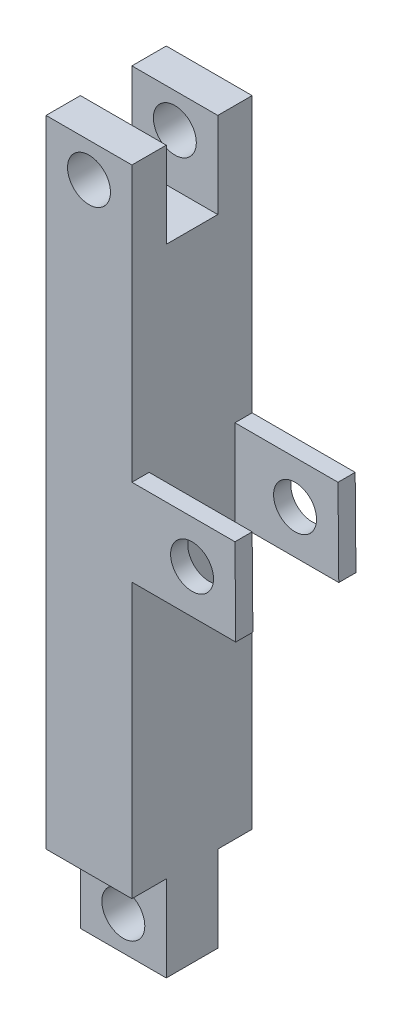
ISO-10303-21;
HEADER;
FILE_DESCRIPTION(('STEP AP214'),'2;1');
FILE_NAME('part.step','',(''),(''),'','','');
FILE_SCHEMA(('AUTOMOTIVE_DESIGN { 1 0 10303 214 1 1 1 1 }'));
ENDSEC;
DATA;
#1=APPLICATION_CONTEXT('core data for automotive mechanical design processes');
#2=APPLICATION_PROTOCOL_DEFINITION('international standard','automotive_design',2000,#1);
#3=PRODUCT_CONTEXT('',#1,'mechanical');
#4=PRODUCT('Part','Part','',(#3));
#5=PRODUCT_RELATED_PRODUCT_CATEGORY('part','',(#4));
#6=PRODUCT_DEFINITION_FORMATION('','',#4);
#7=PRODUCT_DEFINITION_CONTEXT('part definition',#1,'design');
#8=PRODUCT_DEFINITION('design','',#6,#7);
#9=PRODUCT_DEFINITION_SHAPE('','',#8);
#10=(LENGTH_UNIT() NAMED_UNIT(*) SI_UNIT(.MILLI.,.METRE.));
#11=(NAMED_UNIT(*) PLANE_ANGLE_UNIT() SI_UNIT($,.RADIAN.));
#12=(NAMED_UNIT(*) SI_UNIT($,.STERADIAN.) SOLID_ANGLE_UNIT());
#13=UNCERTAINTY_MEASURE_WITH_UNIT(LENGTH_MEASURE(1.E-05),#10,'distance_accuracy_value','');
#14=(GEOMETRIC_REPRESENTATION_CONTEXT(3) GLOBAL_UNCERTAINTY_ASSIGNED_CONTEXT((#13)) GLOBAL_UNIT_ASSIGNED_CONTEXT((#10,
#11,#12)) REPRESENTATION_CONTEXT('',''));
#15=CARTESIAN_POINT('',(0.,0.,0.));
#16=DIRECTION('',(0.,0.,1.));
#17=DIRECTION('',(1.,0.,0.));
#18=AXIS2_PLACEMENT_3D('',#15,#16,#17);
#19=CARTESIAN_POINT('',(0.,-37.,0.));
#20=DIRECTION('',(0.,-1.,0.));
#21=DIRECTION('',(0.,0.,-1.));
#22=AXIS2_PLACEMENT_3D('',#19,#20,#21);
#23=PLANE('',#22);
#24=DIRECTION('',(0.,0.,-1.));
#25=VECTOR('',#24,1.);
#26=CARTESIAN_POINT('',(5.,-37.,-7.));
#27=LINE('',#26,#25);
#28=CARTESIAN_POINT('',(5.,-37.,-3.));
#29=VERTEX_POINT('',#28);
#30=CARTESIAN_POINT('',(5.,-37.,-7.));
#31=VERTEX_POINT('',#30);
#32=EDGE_CURVE('E58',#29,#31,#27,.T.);
#33=ORIENTED_EDGE('',*,*,#32,.F.);
#34=DIRECTION('',(-1.,0.,0.));
#35=VECTOR('',#34,1.);
#36=CARTESIAN_POINT('',(-5.,-37.,-3.));
#37=LINE('',#36,#35);
#38=CARTESIAN_POINT('',(-5.,-37.,-3.));
#39=VERTEX_POINT('',#38);
#40=EDGE_CURVE('E53',#29,#39,#37,.T.);
#41=ORIENTED_EDGE('',*,*,#40,.T.);
#42=DIRECTION('',(0.,0.,1.));
#43=VECTOR('',#42,1.);
#44=CARTESIAN_POINT('',(-5.,-37.,-7.));
#45=LINE('',#44,#43);
#46=CARTESIAN_POINT('',(-5.,-37.,-7.));
#47=VERTEX_POINT('',#46);
#48=EDGE_CURVE('E311',#47,#39,#45,.T.);
#49=ORIENTED_EDGE('',*,*,#48,.F.);
#50=DIRECTION('',(-1.,0.,0.));
#51=VECTOR('',#50,1.);
#52=CARTESIAN_POINT('',(5.,-37.,-7.));
#53=LINE('',#52,#51);
#54=EDGE_CURVE('E308',#31,#47,#53,.T.);
#55=ORIENTED_EDGE('',*,*,#54,.F.);
#56=EDGE_LOOP('',(#33,#41,#49,#55));
#57=FACE_BOUND('',#56,.T.);
#58=ADVANCED_FACE('F36',(#57),#23,.T.);
#59=CARTESIAN_POINT('',(5.,37.,-7.));
#60=DIRECTION('',(-1.,0.,0.));
#61=DIRECTION('',(0.,0.,1.));
#62=AXIS2_PLACEMENT_3D('',#59,#60,#61);
#63=PLANE('',#62);
#64=DIRECTION('',(0.,1.,0.));
#65=VECTOR('',#64,1.);
#66=CARTESIAN_POINT('',(5.,37.,-3.));
#67=LINE('',#66,#65);
#68=CARTESIAN_POINT('',(5.,27.,-3.));
#69=VERTEX_POINT('',#68);
#70=CARTESIAN_POINT('',(5.,37.,-3.));
#71=VERTEX_POINT('',#70);
#72=EDGE_CURVE('E214',#69,#71,#67,.T.);
#73=ORIENTED_EDGE('',*,*,#72,.F.);
#74=DIRECTION('',(0.,0.,1.));
#75=VECTOR('',#74,1.);
#76=CARTESIAN_POINT('',(5.,27.,-3.));
#77=LINE('',#76,#75);
#78=CARTESIAN_POINT('',(5.,27.,3.));
#79=VERTEX_POINT('',#78);
#80=EDGE_CURVE('E226',#69,#79,#77,.T.);
#81=ORIENTED_EDGE('',*,*,#80,.T.);
#82=DIRECTION('',(0.,1.,0.));
#83=VECTOR('',#82,1.);
#84=CARTESIAN_POINT('',(5.,37.,3.));
#85=LINE('',#84,#83);
#86=CARTESIAN_POINT('',(5.,37.,3.));
#87=VERTEX_POINT('',#86);
#88=EDGE_CURVE('E221',#79,#87,#85,.T.);
#89=ORIENTED_EDGE('',*,*,#88,.T.);
#90=DIRECTION('',(0.,0.,-1.));
#91=VECTOR('',#90,1.);
#92=CARTESIAN_POINT('',(5.,37.,-7.));
#93=LINE('',#92,#91);
#94=CARTESIAN_POINT('',(5.,37.,7.));
#95=VERTEX_POINT('',#94);
#96=EDGE_CURVE('E292',#95,#87,#93,.T.);
#97=ORIENTED_EDGE('',*,*,#96,.F.);
#98=DIRECTION('',(0.,-1.,0.));
#99=VECTOR('',#98,1.);
#100=CARTESIAN_POINT('',(5.,37.,7.));
#101=LINE('',#100,#99);
#102=CARTESIAN_POINT('',(5.,5.,7.));
#103=VERTEX_POINT('',#102);
#104=EDGE_CURVE('E316',#95,#103,#101,.T.);
#105=ORIENTED_EDGE('',*,*,#104,.T.);
#106=DIRECTION('',(0.,0.,-1.));
#107=VECTOR('',#106,1.);
#108=CARTESIAN_POINT('',(5.,5.,7.));
#109=LINE('',#108,#107);
#110=CARTESIAN_POINT('',(5.,5.,5.));
#111=VERTEX_POINT('',#110);
#112=EDGE_CURVE('E285',#103,#111,#109,.T.);
#113=ORIENTED_EDGE('',*,*,#112,.T.);
#114=DIRECTION('',(0.,-1.,0.));
#115=VECTOR('',#114,1.);
#116=CARTESIAN_POINT('',(5.,5.,5.));
#117=LINE('',#116,#115);
#118=CARTESIAN_POINT('',(5.,-5.07196207042677,5.));
#119=VERTEX_POINT('',#118);
#120=EDGE_CURVE('E240',#111,#119,#117,.T.);
#121=ORIENTED_EDGE('',*,*,#120,.T.);
#122=DIRECTION('',(0.,0.,-1.));
#123=VECTOR('',#122,1.);
#124=CARTESIAN_POINT('',(5.,-5.07196207042677,7.));
#125=LINE('',#124,#123);
#126=CARTESIAN_POINT('',(5.,-5.07196207042677,7.));
#127=VERTEX_POINT('',#126);
#128=EDGE_CURVE('E281',#127,#119,#125,.T.);
#129=ORIENTED_EDGE('',*,*,#128,.F.);
#130=CARTESIAN_POINT('',(5.,-37.,7.));
#131=VERTEX_POINT('',#130);
#132=EDGE_CURVE('E304',#127,#131,#101,.T.);
#133=ORIENTED_EDGE('',*,*,#132,.T.);
#134=CARTESIAN_POINT('',(5.,-37.,3.));
#135=VERTEX_POINT('',#134);
#136=EDGE_CURVE('E305',#131,#135,#27,.T.);
#137=ORIENTED_EDGE('',*,*,#136,.T.);
#138=DIRECTION('',(0.,1.,0.));
#139=VECTOR('',#138,1.);
#140=CARTESIAN_POINT('',(5.,-37.,3.));
#141=LINE('',#140,#139);
#142=CARTESIAN_POINT('',(5.,-47.,3.));
#143=VERTEX_POINT('',#142);
#144=EDGE_CURVE('E186',#143,#135,#141,.T.);
#145=ORIENTED_EDGE('',*,*,#144,.F.);
#146=DIRECTION('',(0.,0.,-1.));
#147=VECTOR('',#146,1.);
#148=CARTESIAN_POINT('',(5.,-47.,3.));
#149=LINE('',#148,#147);
#150=CARTESIAN_POINT('',(5.,-47.,-3.));
#151=VERTEX_POINT('',#150);
#152=EDGE_CURVE('E182',#143,#151,#149,.T.);
#153=ORIENTED_EDGE('',*,*,#152,.T.);
#154=DIRECTION('',(0.,1.,0.));
#155=VECTOR('',#154,1.);
#156=CARTESIAN_POINT('',(5.,-37.,-3.));
#157=LINE('',#156,#155);
#158=EDGE_CURVE('E349',#151,#29,#157,.T.);
#159=ORIENTED_EDGE('',*,*,#158,.T.);
#160=ORIENTED_EDGE('',*,*,#32,.T.);
#161=DIRECTION('',(0.,-1.,0.));
#162=VECTOR('',#161,1.);
#163=CARTESIAN_POINT('',(5.,37.,-7.));
#164=LINE('',#163,#162);
#165=CARTESIAN_POINT('',(5.,-5.07196207042677,-7.));
#166=VERTEX_POINT('',#165);
#167=EDGE_CURVE('E45',#166,#31,#164,.T.);
#168=ORIENTED_EDGE('',*,*,#167,.F.);
#169=CARTESIAN_POINT('',(5.,-5.07196207042677,-5.));
#170=VERTEX_POINT('',#169);
#171=EDGE_CURVE('E280',#170,#166,#125,.T.);
#172=ORIENTED_EDGE('',*,*,#171,.F.);
#173=DIRECTION('',(0.,-1.,0.));
#174=VECTOR('',#173,1.);
#175=CARTESIAN_POINT('',(5.,5.,-5.));
#176=LINE('',#175,#174);
#177=CARTESIAN_POINT('',(5.,5.,-5.));
#178=VERTEX_POINT('',#177);
#179=EDGE_CURVE('E241',#178,#170,#176,.T.);
#180=ORIENTED_EDGE('',*,*,#179,.F.);
#181=CARTESIAN_POINT('',(5.,5.,-7.));
#182=VERTEX_POINT('',#181);
#183=EDGE_CURVE('E284',#178,#182,#109,.T.);
#184=ORIENTED_EDGE('',*,*,#183,.T.);
#185=CARTESIAN_POINT('',(5.,37.,-7.));
#186=VERTEX_POINT('',#185);
#187=EDGE_CURVE('E11',#186,#182,#164,.T.);
#188=ORIENTED_EDGE('',*,*,#187,.F.);
#189=EDGE_CURVE('E296',#71,#186,#93,.T.);
#190=ORIENTED_EDGE('',*,*,#189,.F.);
#191=EDGE_LOOP('',(#73,#81,#89,#97,#105,#113,#121,#129,#133,#137,#145,#153,#159,#160,#168,#172,
#180,#184,#188,#190));
#192=FACE_BOUND('',#191,.T.);
#193=ADVANCED_FACE('F38',(#192),#63,.F.);
#194=CARTESIAN_POINT('',(-5.,37.,-7.));
#195=DIRECTION('',(1.,0.,0.));
#196=DIRECTION('',(0.,0.,-1.));
#197=AXIS2_PLACEMENT_3D('',#194,#195,#196);
#198=PLANE('',#197);
#199=DIRECTION('',(0.,-1.,0.));
#200=VECTOR('',#199,1.);
#201=CARTESIAN_POINT('',(-5.,37.,-3.));
#202=LINE('',#201,#200);
#203=CARTESIAN_POINT('',(-5.,37.,-3.));
#204=VERTEX_POINT('',#203);
#205=CARTESIAN_POINT('',(-5.,27.,-3.));
#206=VERTEX_POINT('',#205);
#207=EDGE_CURVE('E207',#204,#206,#202,.T.);
#208=ORIENTED_EDGE('',*,*,#207,.F.);
#209=DIRECTION('',(0.,0.,1.));
#210=VECTOR('',#209,1.);
#211=CARTESIAN_POINT('',(-5.,37.,-7.));
#212=LINE('',#211,#210);
#213=CARTESIAN_POINT('',(-5.,37.,-7.));
#214=VERTEX_POINT('',#213);
#215=EDGE_CURVE('E299',#214,#204,#212,.T.);
#216=ORIENTED_EDGE('',*,*,#215,.F.);
#217=DIRECTION('',(0.,-1.,0.));
#218=VECTOR('',#217,1.);
#219=CARTESIAN_POINT('',(-5.,37.,-7.));
#220=LINE('',#219,#218);
#221=EDGE_CURVE('E322',#214,#47,#220,.T.);
#222=ORIENTED_EDGE('',*,*,#221,.T.);
#223=ORIENTED_EDGE('',*,*,#48,.T.);
#224=DIRECTION('',(0.,-1.,0.));
#225=VECTOR('',#224,1.);
#226=CARTESIAN_POINT('',(-5.,-37.,-3.));
#227=LINE('',#226,#225);
#228=CARTESIAN_POINT('',(-5.,-47.,-3.));
#229=VERTEX_POINT('',#228);
#230=EDGE_CURVE('E198',#39,#229,#227,.T.);
#231=ORIENTED_EDGE('',*,*,#230,.T.);
#232=DIRECTION('',(0.,0.,-1.));
#233=VECTOR('',#232,1.);
#234=CARTESIAN_POINT('',(-5.,-47.,3.));
#235=LINE('',#234,#233);
#236=CARTESIAN_POINT('',(-5.,-47.,3.));
#237=VERTEX_POINT('',#236);
#238=EDGE_CURVE('E179',#237,#229,#235,.T.);
#239=ORIENTED_EDGE('',*,*,#238,.F.);
#240=DIRECTION('',(0.,-1.,0.));
#241=VECTOR('',#240,1.);
#242=CARTESIAN_POINT('',(-5.,-37.,3.));
#243=LINE('',#242,#241);
#244=CARTESIAN_POINT('',(-5.,-37.,3.));
#245=VERTEX_POINT('',#244);
#246=EDGE_CURVE('E187',#245,#237,#243,.T.);
#247=ORIENTED_EDGE('',*,*,#246,.F.);
#248=CARTESIAN_POINT('',(-5.,-37.,7.));
#249=VERTEX_POINT('',#248);
#250=EDGE_CURVE('E310',#245,#249,#45,.T.);
#251=ORIENTED_EDGE('',*,*,#250,.T.);
#252=DIRECTION('',(0.,-1.,0.));
#253=VECTOR('',#252,1.);
#254=CARTESIAN_POINT('',(-5.,37.,7.));
#255=LINE('',#254,#253);
#256=CARTESIAN_POINT('',(-5.,37.,7.));
#257=VERTEX_POINT('',#256);
#258=EDGE_CURVE('E319',#257,#249,#255,.T.);
#259=ORIENTED_EDGE('',*,*,#258,.F.);
#260=CARTESIAN_POINT('',(-5.,37.,3.));
#261=VERTEX_POINT('',#260);
#262=EDGE_CURVE('E298',#261,#257,#212,.T.);
#263=ORIENTED_EDGE('',*,*,#262,.F.);
#264=DIRECTION('',(0.,-1.,0.));
#265=VECTOR('',#264,1.);
#266=CARTESIAN_POINT('',(-5.,37.,3.));
#267=LINE('',#266,#265);
#268=CARTESIAN_POINT('',(-5.,27.,3.));
#269=VERTEX_POINT('',#268);
#270=EDGE_CURVE('E199',#261,#269,#267,.T.);
#271=ORIENTED_EDGE('',*,*,#270,.T.);
#272=DIRECTION('',(0.,0.,1.));
#273=VECTOR('',#272,1.);
#274=CARTESIAN_POINT('',(-5.,27.,-3.));
#275=LINE('',#274,#273);
#276=EDGE_CURVE('E217',#206,#269,#275,.T.);
#277=ORIENTED_EDGE('',*,*,#276,.F.);
#278=EDGE_LOOP('',(#208,#216,#222,#223,#231,#239,#247,#251,#259,#263,#271,#277));
#279=FACE_BOUND('',#278,.T.);
#280=ADVANCED_FACE('F196',(#279),#198,.F.);
#281=CARTESIAN_POINT('',(0.,37.,0.));
#282=DIRECTION('',(0.,-1.,0.));
#283=DIRECTION('',(0.,0.,-1.));
#284=AXIS2_PLACEMENT_3D('',#281,#282,#283);
#285=PLANE('',#284);
#286=DIRECTION('',(-1.,0.,0.));
#287=VECTOR('',#286,1.);
#288=CARTESIAN_POINT('',(-5.,37.,-3.));
#289=LINE('',#288,#287);
#290=EDGE_CURVE('E216',#71,#204,#289,.T.);
#291=ORIENTED_EDGE('',*,*,#290,.F.);
#292=ORIENTED_EDGE('',*,*,#189,.T.);
#293=DIRECTION('',(-1.,0.,0.));
#294=VECTOR('',#293,1.);
#295=CARTESIAN_POINT('',(5.,37.,-7.));
#296=LINE('',#295,#294);
#297=EDGE_CURVE('E295',#186,#214,#296,.T.);
#298=ORIENTED_EDGE('',*,*,#297,.T.);
#299=ORIENTED_EDGE('',*,*,#215,.T.);
#300=EDGE_LOOP('',(#291,#292,#298,#299));
#301=FACE_BOUND('',#300,.T.);
#302=ADVANCED_FACE('F394',(#301),#285,.F.);
#303=CARTESIAN_POINT('',(17.,5.,7.));
#304=DIRECTION('',(-0.999959845190565,-0.00896147345366372,0.));
#305=DIRECTION('',(0.00896147345366372,-0.999959845190565,0.));
#306=AXIS2_PLACEMENT_3D('',#303,#304,#305);
#307=PLANE('',#306);
#308=DIRECTION('',(-0.00896147345366372,0.999959845190565,0.));
#309=VECTOR('',#308,1.);
#310=CARTESIAN_POINT('',(17.,5.,-5.));
#311=LINE('',#310,#309);
#312=CARTESIAN_POINT('',(17.0902632452238,-5.07196207042677,-5.));
#313=VERTEX_POINT('',#312);
#314=CARTESIAN_POINT('',(17.,5.,-5.));
#315=VERTEX_POINT('',#314);
#316=EDGE_CURVE('E258',#313,#315,#311,.T.);
#317=ORIENTED_EDGE('',*,*,#316,.F.);
#318=DIRECTION('',(0.,0.,-1.));
#319=VECTOR('',#318,1.);
#320=CARTESIAN_POINT('',(17.0902632452238,-5.07196207042677,7.));
#321=LINE('',#320,#319);
#322=CARTESIAN_POINT('',(17.0902632452238,-5.07196207042677,-7.));
#323=VERTEX_POINT('',#322);
#324=EDGE_CURVE('E269',#313,#323,#321,.T.);
#325=ORIENTED_EDGE('',*,*,#324,.T.);
#326=DIRECTION('',(-0.00896147345366372,0.999959845190565,0.));
#327=VECTOR('',#326,1.);
#328=CARTESIAN_POINT('',(17.,5.,-7.));
#329=LINE('',#328,#327);
#330=CARTESIAN_POINT('',(17.,5.,-7.));
#331=VERTEX_POINT('',#330);
#332=EDGE_CURVE('E260',#323,#331,#329,.T.);
#333=ORIENTED_EDGE('',*,*,#332,.T.);
#334=DIRECTION('',(0.,0.,-1.));
#335=VECTOR('',#334,1.);
#336=CARTESIAN_POINT('',(17.,5.,7.));
#337=LINE('',#336,#335);
#338=EDGE_CURVE('E288',#315,#331,#337,.T.);
#339=ORIENTED_EDGE('',*,*,#338,.F.);
#340=EDGE_LOOP('',(#317,#325,#333,#339));
#341=FACE_BOUND('',#340,.T.);
#342=ADVANCED_FACE('F391',(#341),#307,.F.);
#343=CARTESIAN_POINT('',(5.,5.,7.));
#344=DIRECTION('',(0.,-1.,0.));
#345=DIRECTION('',(0.,0.,-1.));
#346=AXIS2_PLACEMENT_3D('',#343,#344,#345);
#347=PLANE('',#346);
#348=DIRECTION('',(-1.,0.,0.));
#349=VECTOR('',#348,1.);
#350=CARTESIAN_POINT('',(5.,5.,-5.));
#351=LINE('',#350,#349);
#352=EDGE_CURVE('E246',#315,#178,#351,.T.);
#353=ORIENTED_EDGE('',*,*,#352,.F.);
#354=ORIENTED_EDGE('',*,*,#338,.T.);
#355=DIRECTION('',(-1.,0.,0.));
#356=VECTOR('',#355,1.);
#357=CARTESIAN_POINT('',(5.,5.,-7.));
#358=LINE('',#357,#356);
#359=EDGE_CURVE('E272',#331,#182,#358,.T.);
#360=ORIENTED_EDGE('',*,*,#359,.T.);
#361=ORIENTED_EDGE('',*,*,#183,.F.);
#362=EDGE_LOOP('',(#353,#354,#360,#361));
#363=FACE_BOUND('',#362,.T.);
#364=ADVANCED_FACE('F439',(#363),#347,.F.);
#365=CARTESIAN_POINT('',(17.0902632452238,-5.07196207042677,7.));
#366=DIRECTION('',(0.,1.,0.));
#367=DIRECTION('',(-1.,0.,0.));
#368=AXIS2_PLACEMENT_3D('',#365,#366,#367);
#369=PLANE('',#368);
#370=DIRECTION('',(1.,0.,0.));
#371=VECTOR('',#370,1.);
#372=CARTESIAN_POINT('',(5.,-5.07196207042677,-5.));
#373=LINE('',#372,#371);
#374=EDGE_CURVE('E243',#170,#313,#373,.T.);
#375=ORIENTED_EDGE('',*,*,#374,.F.);
#376=ORIENTED_EDGE('',*,*,#171,.T.);
#377=DIRECTION('',(1.,0.,0.));
#378=VECTOR('',#377,1.);
#379=CARTESIAN_POINT('',(17.0902632452238,-5.07196207042677,-7.));
#380=LINE('',#379,#378);
#381=EDGE_CURVE('E265',#166,#323,#380,.T.);
#382=ORIENTED_EDGE('',*,*,#381,.T.);
#383=ORIENTED_EDGE('',*,*,#324,.F.);
#384=EDGE_LOOP('',(#375,#376,#382,#383));
#385=FACE_BOUND('',#384,.T.);
#386=ADVANCED_FACE('F429',(#385),#369,.F.);
#387=CARTESIAN_POINT('',(5.,37.,-7.));
#388=DIRECTION('',(0.,0.,1.));
#389=DIRECTION('',(1.,0.,0.));
#390=AXIS2_PLACEMENT_3D('',#387,#388,#389);
#391=PLANE('',#390);
#392=CARTESIAN_POINT('',(0.,33.,-7.));
#393=DIRECTION('',(0.,0.,1.));
#394=DIRECTION('',(1.,0.,0.));
#395=AXIS2_PLACEMENT_3D('',#392,#393,#394);
#396=CIRCLE('',#395,2.5);
#397=CARTESIAN_POINT('',(2.5,33.,-7.));
#398=VERTEX_POINT('',#397);
#399=EDGE_CURVE('E329',#398,#398,#396,.T.);
#400=ORIENTED_EDGE('',*,*,#399,.T.);
#401=EDGE_LOOP('',(#400));
#402=FACE_BOUND('',#401,.T.);
#403=CARTESIAN_POINT('',(12.,0.,-7.));
#404=DIRECTION('',(0.,0.,1.));
#405=DIRECTION('',(1.,0.,0.));
#406=AXIS2_PLACEMENT_3D('',#403,#404,#405);
#407=CIRCLE('',#406,2.5);
#408=CARTESIAN_POINT('',(14.5,0.,-7.));
#409=VERTEX_POINT('',#408);
#410=EDGE_CURVE('E233',#409,#409,#407,.T.);
#411=ORIENTED_EDGE('',*,*,#410,.T.);
#412=EDGE_LOOP('',(#411));
#413=FACE_BOUND('',#412,.T.);
#414=ORIENTED_EDGE('',*,*,#54,.T.);
#415=ORIENTED_EDGE('',*,*,#221,.F.);
#416=ORIENTED_EDGE('',*,*,#297,.F.);
#417=ORIENTED_EDGE('',*,*,#187,.T.);
#418=ORIENTED_EDGE('',*,*,#359,.F.);
#419=ORIENTED_EDGE('',*,*,#332,.F.);
#420=ORIENTED_EDGE('',*,*,#381,.F.);
#421=ORIENTED_EDGE('',*,*,#167,.T.);
#422=EDGE_LOOP('',(#414,#415,#416,#417,#418,#419,#420,#421));
#423=FACE_BOUND('',#422,.T.);
#424=ADVANCED_FACE('F421',(#402,#413,#423),#391,.F.);
#425=CARTESIAN_POINT('',(5.,37.,7.));
#426=DIRECTION('',(0.,0.,-1.));
#427=DIRECTION('',(-1.,0.,0.));
#428=AXIS2_PLACEMENT_3D('',#425,#426,#427);
#429=PLANE('',#428);
#430=CARTESIAN_POINT('',(0.,33.,7.));
#431=DIRECTION('',(0.,0.,1.));
#432=DIRECTION('',(1.,0.,0.));
#433=AXIS2_PLACEMENT_3D('',#430,#431,#432);
#434=CIRCLE('',#433,2.5);
#435=CARTESIAN_POINT('',(2.5,33.,7.));
#436=VERTEX_POINT('',#435);
#437=EDGE_CURVE('E335',#436,#436,#434,.T.);
#438=ORIENTED_EDGE('',*,*,#437,.F.);
#439=EDGE_LOOP('',(#438));
#440=FACE_BOUND('',#439,.T.);
#441=CARTESIAN_POINT('',(12.,0.,7.));
#442=DIRECTION('',(0.,0.,1.));
#443=DIRECTION('',(1.,0.,0.));
#444=AXIS2_PLACEMENT_3D('',#441,#442,#443);
#445=CIRCLE('',#444,2.5);
#446=CARTESIAN_POINT('',(14.5,0.,7.));
#447=VERTEX_POINT('',#446);
#448=EDGE_CURVE('E229',#447,#447,#445,.T.);
#449=ORIENTED_EDGE('',*,*,#448,.F.);
#450=EDGE_LOOP('',(#449));
#451=FACE_BOUND('',#450,.T.);
#452=DIRECTION('',(1.,0.,0.));
#453=VECTOR('',#452,1.);
#454=CARTESIAN_POINT('',(5.,-37.,7.));
#455=LINE('',#454,#453);
#456=EDGE_CURVE('E313',#249,#131,#455,.T.);
#457=ORIENTED_EDGE('',*,*,#456,.T.);
#458=ORIENTED_EDGE('',*,*,#132,.F.);
#459=DIRECTION('',(1.,0.,0.));
#460=VECTOR('',#459,1.);
#461=CARTESIAN_POINT('',(17.0902632452238,-5.07196207042677,7.));
#462=LINE('',#461,#460);
#463=CARTESIAN_POINT('',(17.0902632452238,-5.07196207042677,7.));
#464=VERTEX_POINT('',#463);
#465=EDGE_CURVE('E267',#127,#464,#462,.T.);
#466=ORIENTED_EDGE('',*,*,#465,.T.);
#467=DIRECTION('',(-0.00896147345366372,0.999959845190565,0.));
#468=VECTOR('',#467,1.);
#469=CARTESIAN_POINT('',(17.,5.,7.));
#470=LINE('',#469,#468);
#471=CARTESIAN_POINT('',(17.,5.,7.));
#472=VERTEX_POINT('',#471);
#473=EDGE_CURVE('E261',#464,#472,#470,.T.);
#474=ORIENTED_EDGE('',*,*,#473,.T.);
#475=DIRECTION('',(-1.,0.,0.));
#476=VECTOR('',#475,1.);
#477=CARTESIAN_POINT('',(5.,5.,7.));
#478=LINE('',#477,#476);
#479=EDGE_CURVE('E264',#472,#103,#478,.T.);
#480=ORIENTED_EDGE('',*,*,#479,.T.);
#481=ORIENTED_EDGE('',*,*,#104,.F.);
#482=DIRECTION('',(1.,0.,0.));
#483=VECTOR('',#482,1.);
#484=CARTESIAN_POINT('',(5.,37.,7.));
#485=LINE('',#484,#483);
#486=EDGE_CURVE('E302',#257,#95,#485,.T.);
#487=ORIENTED_EDGE('',*,*,#486,.F.);
#488=ORIENTED_EDGE('',*,*,#258,.T.);
#489=EDGE_LOOP('',(#457,#458,#466,#474,#480,#481,#487,#488));
#490=FACE_BOUND('',#489,.T.);
#491=ADVANCED_FACE('F392',(#440,#451,#490),#429,.F.);
#492=ORIENTED_EDGE('',*,*,#96,.T.);
#493=DIRECTION('',(-1.,0.,0.));
#494=VECTOR('',#493,1.);
#495=CARTESIAN_POINT('',(-5.,37.,3.));
#496=LINE('',#495,#494);
#497=EDGE_CURVE('E211',#87,#261,#496,.T.);
#498=ORIENTED_EDGE('',*,*,#497,.T.);
#499=ORIENTED_EDGE('',*,*,#262,.T.);
#500=ORIENTED_EDGE('',*,*,#486,.T.);
#501=EDGE_LOOP('',(#492,#498,#499,#500));
#502=FACE_BOUND('',#501,.T.);
#503=ADVANCED_FACE('F382',(#502),#285,.F.);
#504=DIRECTION('',(-1.,0.,0.));
#505=VECTOR('',#504,1.);
#506=CARTESIAN_POINT('',(-5.,-37.,3.));
#507=LINE('',#506,#505);
#508=EDGE_CURVE('E192',#135,#245,#507,.T.);
#509=ORIENTED_EDGE('',*,*,#508,.F.);
#510=ORIENTED_EDGE('',*,*,#136,.F.);
#511=ORIENTED_EDGE('',*,*,#456,.F.);
#512=ORIENTED_EDGE('',*,*,#250,.F.);
#513=EDGE_LOOP('',(#509,#510,#511,#512));
#514=FACE_BOUND('',#513,.T.);
#515=ADVANCED_FACE('F374',(#514),#23,.T.);
#516=CARTESIAN_POINT('',(17.0902632452238,-5.07196207042677,5.));
#517=VERTEX_POINT('',#516);
#518=EDGE_CURVE('E277',#464,#517,#321,.T.);
#519=ORIENTED_EDGE('',*,*,#518,.T.);
#520=DIRECTION('',(-0.00896147345366372,0.999959845190565,0.));
#521=VECTOR('',#520,1.);
#522=CARTESIAN_POINT('',(17.,5.,5.));
#523=LINE('',#522,#521);
#524=CARTESIAN_POINT('',(17.,5.,5.));
#525=VERTEX_POINT('',#524);
#526=EDGE_CURVE('E248',#517,#525,#523,.T.);
#527=ORIENTED_EDGE('',*,*,#526,.T.);
#528=EDGE_CURVE('E289',#472,#525,#337,.T.);
#529=ORIENTED_EDGE('',*,*,#528,.F.);
#530=ORIENTED_EDGE('',*,*,#473,.F.);
#531=EDGE_LOOP('',(#519,#527,#529,#530));
#532=FACE_BOUND('',#531,.T.);
#533=ADVANCED_FACE('F381',(#532),#307,.F.);
#534=ORIENTED_EDGE('',*,*,#528,.T.);
#535=DIRECTION('',(-1.,0.,0.));
#536=VECTOR('',#535,1.);
#537=CARTESIAN_POINT('',(5.,5.,5.));
#538=LINE('',#537,#536);
#539=EDGE_CURVE('E244',#525,#111,#538,.T.);
#540=ORIENTED_EDGE('',*,*,#539,.T.);
#541=ORIENTED_EDGE('',*,*,#112,.F.);
#542=ORIENTED_EDGE('',*,*,#479,.F.);
#543=EDGE_LOOP('',(#534,#540,#541,#542));
#544=FACE_BOUND('',#543,.T.);
#545=ADVANCED_FACE('F388',(#544),#347,.F.);
#546=ORIENTED_EDGE('',*,*,#128,.T.);
#547=DIRECTION('',(1.,0.,0.));
#548=VECTOR('',#547,1.);
#549=CARTESIAN_POINT('',(5.,-5.07196207042677,5.));
#550=LINE('',#549,#548);
#551=EDGE_CURVE('E251',#119,#517,#550,.T.);
#552=ORIENTED_EDGE('',*,*,#551,.T.);
#553=ORIENTED_EDGE('',*,*,#518,.F.);
#554=ORIENTED_EDGE('',*,*,#465,.F.);
#555=EDGE_LOOP('',(#546,#552,#553,#554));
#556=FACE_BOUND('',#555,.T.);
#557=ADVANCED_FACE('F447',(#556),#369,.F.);
#558=CARTESIAN_POINT('',(0.,0.,-5.));
#559=DIRECTION('',(0.,0.,1.));
#560=DIRECTION('',(1.,0.,0.));
#561=AXIS2_PLACEMENT_3D('',#558,#559,#560);
#562=PLANE('',#561);
#563=CARTESIAN_POINT('',(12.,0.,-5.));
#564=DIRECTION('',(0.,0.,1.));
#565=DIRECTION('',(1.,0.,0.));
#566=AXIS2_PLACEMENT_3D('',#563,#564,#565);
#567=CIRCLE('',#566,2.5);
#568=CARTESIAN_POINT('',(14.5,0.,-5.));
#569=VERTEX_POINT('',#568);
#570=EDGE_CURVE('E237',#569,#569,#567,.T.);
#571=ORIENTED_EDGE('',*,*,#570,.F.);
#572=EDGE_LOOP('',(#571));
#573=FACE_BOUND('',#572,.T.);
#574=ORIENTED_EDGE('',*,*,#316,.T.);
#575=ORIENTED_EDGE('',*,*,#352,.T.);
#576=ORIENTED_EDGE('',*,*,#179,.T.);
#577=ORIENTED_EDGE('',*,*,#374,.T.);
#578=EDGE_LOOP('',(#574,#575,#576,#577));
#579=FACE_BOUND('',#578,.T.);
#580=ADVANCED_FACE('F433',(#573,#579),#562,.T.);
#581=CARTESIAN_POINT('',(0.,0.,5.));
#582=DIRECTION('',(0.,0.,1.));
#583=DIRECTION('',(1.,0.,0.));
#584=AXIS2_PLACEMENT_3D('',#581,#582,#583);
#585=PLANE('',#584);
#586=CARTESIAN_POINT('',(12.,0.,5.));
#587=DIRECTION('',(0.,0.,1.));
#588=DIRECTION('',(1.,0.,0.));
#589=AXIS2_PLACEMENT_3D('',#586,#587,#588);
#590=CIRCLE('',#589,2.5);
#591=CARTESIAN_POINT('',(14.5,0.,5.));
#592=VERTEX_POINT('',#591);
#593=EDGE_CURVE('E236',#592,#592,#590,.T.);
#594=ORIENTED_EDGE('',*,*,#593,.T.);
#595=EDGE_LOOP('',(#594));
#596=FACE_BOUND('',#595,.T.);
#597=ORIENTED_EDGE('',*,*,#551,.F.);
#598=ORIENTED_EDGE('',*,*,#120,.F.);
#599=ORIENTED_EDGE('',*,*,#539,.F.);
#600=ORIENTED_EDGE('',*,*,#526,.F.);
#601=EDGE_LOOP('',(#597,#598,#599,#600));
#602=FACE_BOUND('',#601,.T.);
#603=ADVANCED_FACE('F459',(#596,#602),#585,.F.);
#604=CARTESIAN_POINT('',(12.,0.,-7.));
#605=DIRECTION('',(0.,0.,1.));
#606=DIRECTION('',(1.,0.,0.));
#607=AXIS2_PLACEMENT_3D('',#604,#605,#606);
#608=CYLINDRICAL_SURFACE('',#607,2.5);
#609=ORIENTED_EDGE('',*,*,#448,.T.);
#610=EDGE_LOOP('',(#609));
#611=FACE_BOUND('',#610,.T.);
#612=ORIENTED_EDGE('',*,*,#593,.F.);
#613=EDGE_LOOP('',(#612));
#614=FACE_BOUND('',#613,.T.);
#615=ADVANCED_FACE('F461',(#611,#614),#608,.F.);
#616=ORIENTED_EDGE('',*,*,#570,.T.);
#617=EDGE_LOOP('',(#616));
#618=FACE_BOUND('',#617,.T.);
#619=ORIENTED_EDGE('',*,*,#410,.F.);
#620=EDGE_LOOP('',(#619));
#621=FACE_BOUND('',#620,.T.);
#622=ADVANCED_FACE('F468',(#618,#621),#608,.F.);
#623=CARTESIAN_POINT('',(-5.,27.,-3.));
#624=DIRECTION('',(0.,-1.,0.));
#625=DIRECTION('',(0.,0.,-1.));
#626=AXIS2_PLACEMENT_3D('',#623,#624,#625);
#627=PLANE('',#626);
#628=DIRECTION('',(1.,0.,0.));
#629=VECTOR('',#628,1.);
#630=CARTESIAN_POINT('',(-5.,27.,3.));
#631=LINE('',#630,#629);
#632=EDGE_CURVE('E202',#269,#79,#631,.T.);
#633=ORIENTED_EDGE('',*,*,#632,.T.);
#634=ORIENTED_EDGE('',*,*,#80,.F.);
#635=DIRECTION('',(1.,0.,0.));
#636=VECTOR('',#635,1.);
#637=CARTESIAN_POINT('',(-5.,27.,-3.));
#638=LINE('',#637,#636);
#639=EDGE_CURVE('E210',#206,#69,#638,.T.);
#640=ORIENTED_EDGE('',*,*,#639,.F.);
#641=ORIENTED_EDGE('',*,*,#276,.T.);
#642=EDGE_LOOP('',(#633,#634,#640,#641));
#643=FACE_BOUND('',#642,.T.);
#644=ADVANCED_FACE('F411',(#643),#627,.F.);
#645=CARTESIAN_POINT('',(0.,0.,-3.));
#646=DIRECTION('',(0.,0.,1.));
#647=DIRECTION('',(1.,0.,0.));
#648=AXIS2_PLACEMENT_3D('',#645,#646,#647);
#649=PLANE('',#648);
#650=CARTESIAN_POINT('',(0.,33.,-3.));
#651=DIRECTION('',(0.,0.,1.));
#652=DIRECTION('',(1.,0.,0.));
#653=AXIS2_PLACEMENT_3D('',#650,#651,#652);
#654=CIRCLE('',#653,2.5);
#655=CARTESIAN_POINT('',(2.5,33.,-3.));
#656=VERTEX_POINT('',#655);
#657=EDGE_CURVE('E328',#656,#656,#654,.T.);
#658=ORIENTED_EDGE('',*,*,#657,.F.);
#659=EDGE_LOOP('',(#658));
#660=FACE_BOUND('',#659,.T.);
#661=ORIENTED_EDGE('',*,*,#207,.T.);
#662=ORIENTED_EDGE('',*,*,#639,.T.);
#663=ORIENTED_EDGE('',*,*,#72,.T.);
#664=ORIENTED_EDGE('',*,*,#290,.T.);
#665=EDGE_LOOP('',(#661,#662,#663,#664));
#666=FACE_BOUND('',#665,.T.);
#667=ADVANCED_FACE('F413',(#660,#666),#649,.T.);
#668=CARTESIAN_POINT('',(0.,0.,3.));
#669=DIRECTION('',(0.,0.,1.));
#670=DIRECTION('',(1.,0.,0.));
#671=AXIS2_PLACEMENT_3D('',#668,#669,#670);
#672=PLANE('',#671);
#673=CARTESIAN_POINT('',(0.,33.,3.));
#674=DIRECTION('',(0.,0.,1.));
#675=DIRECTION('',(1.,0.,0.));
#676=AXIS2_PLACEMENT_3D('',#673,#674,#675);
#677=CIRCLE('',#676,2.5);
#678=CARTESIAN_POINT('',(2.5,33.,3.));
#679=VERTEX_POINT('',#678);
#680=EDGE_CURVE('E326',#679,#679,#677,.T.);
#681=ORIENTED_EDGE('',*,*,#680,.T.);
#682=EDGE_LOOP('',(#681));
#683=FACE_BOUND('',#682,.T.);
#684=ORIENTED_EDGE('',*,*,#270,.F.);
#685=ORIENTED_EDGE('',*,*,#497,.F.);
#686=ORIENTED_EDGE('',*,*,#88,.F.);
#687=ORIENTED_EDGE('',*,*,#632,.F.);
#688=EDGE_LOOP('',(#684,#685,#686,#687));
#689=FACE_BOUND('',#688,.T.);
#690=ADVANCED_FACE('F407',(#683,#689),#672,.F.);
#691=CARTESIAN_POINT('',(-5.,-47.,3.));
#692=DIRECTION('',(0.,1.,0.));
#693=DIRECTION('',(0.,0.,1.));
#694=AXIS2_PLACEMENT_3D('',#691,#692,#693);
#695=PLANE('',#694);
#696=DIRECTION('',(1.,0.,0.));
#697=VECTOR('',#696,1.);
#698=CARTESIAN_POINT('',(-5.,-47.,-3.));
#699=LINE('',#698,#697);
#700=EDGE_CURVE('E347',#229,#151,#699,.T.);
#701=ORIENTED_EDGE('',*,*,#700,.T.);
#702=ORIENTED_EDGE('',*,*,#152,.F.);
#703=DIRECTION('',(1.,0.,0.));
#704=VECTOR('',#703,1.);
#705=CARTESIAN_POINT('',(-5.,-47.,3.));
#706=LINE('',#705,#704);
#707=EDGE_CURVE('E175',#237,#143,#706,.T.);
#708=ORIENTED_EDGE('',*,*,#707,.F.);
#709=ORIENTED_EDGE('',*,*,#238,.T.);
#710=EDGE_LOOP('',(#701,#702,#708,#709));
#711=FACE_BOUND('',#710,.T.);
#712=ADVANCED_FACE('F177',(#711),#695,.F.);
#713=CARTESIAN_POINT('',(0.,0.,3.));
#714=DIRECTION('',(0.,0.,1.));
#715=DIRECTION('',(1.,0.,0.));
#716=AXIS2_PLACEMENT_3D('',#713,#714,#715);
#717=PLANE('',#716);
#718=CARTESIAN_POINT('',(0.,-43.,3.));
#719=DIRECTION('',(0.,0.,1.));
#720=DIRECTION('',(1.,0.,0.));
#721=AXIS2_PLACEMENT_3D('',#718,#719,#720);
#722=CIRCLE('',#721,2.5);
#723=CARTESIAN_POINT('',(2.5,-43.,3.));
#724=VERTEX_POINT('',#723);
#725=EDGE_CURVE('E340',#724,#724,#722,.T.);
#726=ORIENTED_EDGE('',*,*,#725,.F.);
#727=EDGE_LOOP('',(#726));
#728=FACE_BOUND('',#727,.T.);
#729=ORIENTED_EDGE('',*,*,#246,.T.);
#730=ORIENTED_EDGE('',*,*,#707,.T.);
#731=ORIENTED_EDGE('',*,*,#144,.T.);
#732=ORIENTED_EDGE('',*,*,#508,.T.);
#733=EDGE_LOOP('',(#729,#730,#731,#732));
#734=FACE_BOUND('',#733,.T.);
#735=ADVANCED_FACE('F191',(#728,#734),#717,.T.);
#736=CARTESIAN_POINT('',(0.,0.,-3.));
#737=DIRECTION('',(0.,0.,1.));
#738=DIRECTION('',(1.,0.,0.));
#739=AXIS2_PLACEMENT_3D('',#736,#737,#738);
#740=PLANE('',#739);
#741=CARTESIAN_POINT('',(0.,-43.,-3.));
#742=DIRECTION('',(0.,0.,1.));
#743=DIRECTION('',(1.,0.,0.));
#744=AXIS2_PLACEMENT_3D('',#741,#742,#743);
#745=CIRCLE('',#744,2.5);
#746=CARTESIAN_POINT('',(2.5,-43.,-3.));
#747=VERTEX_POINT('',#746);
#748=EDGE_CURVE('E40',#747,#747,#745,.T.);
#749=ORIENTED_EDGE('',*,*,#748,.T.);
#750=EDGE_LOOP('',(#749));
#751=FACE_BOUND('',#750,.T.);
#752=ORIENTED_EDGE('',*,*,#230,.F.);
#753=ORIENTED_EDGE('',*,*,#40,.F.);
#754=ORIENTED_EDGE('',*,*,#158,.F.);
#755=ORIENTED_EDGE('',*,*,#700,.F.);
#756=EDGE_LOOP('',(#752,#753,#754,#755));
#757=FACE_BOUND('',#756,.T.);
#758=ADVANCED_FACE('F356',(#751,#757),#740,.F.);
#759=CARTESIAN_POINT('',(0.,33.,-7.));
#760=DIRECTION('',(0.,0.,1.));
#761=DIRECTION('',(1.,0.,0.));
#762=AXIS2_PLACEMENT_3D('',#759,#760,#761);
#763=CYLINDRICAL_SURFACE('',#762,2.5);
#764=ORIENTED_EDGE('',*,*,#437,.T.);
#765=EDGE_LOOP('',(#764));
#766=FACE_BOUND('',#765,.T.);
#767=ORIENTED_EDGE('',*,*,#680,.F.);
#768=EDGE_LOOP('',(#767));
#769=FACE_BOUND('',#768,.T.);
#770=ADVANCED_FACE('F358',(#766,#769),#763,.F.);
#771=ORIENTED_EDGE('',*,*,#657,.T.);
#772=EDGE_LOOP('',(#771));
#773=FACE_BOUND('',#772,.T.);
#774=ORIENTED_EDGE('',*,*,#399,.F.);
#775=EDGE_LOOP('',(#774));
#776=FACE_BOUND('',#775,.T.);
#777=ADVANCED_FACE('F365',(#773,#776),#763,.F.);
#778=CARTESIAN_POINT('',(0.,-43.,-7.));
#779=DIRECTION('',(0.,0.,1.));
#780=DIRECTION('',(1.,0.,0.));
#781=AXIS2_PLACEMENT_3D('',#778,#779,#780);
#782=CYLINDRICAL_SURFACE('',#781,2.5);
#783=ORIENTED_EDGE('',*,*,#725,.T.);
#784=EDGE_LOOP('',(#783));
#785=FACE_BOUND('',#784,.T.);
#786=ORIENTED_EDGE('',*,*,#748,.F.);
#787=EDGE_LOOP('',(#786));
#788=FACE_BOUND('',#787,.T.);
#789=ADVANCED_FACE('F507',(#785,#788),#782,.F.);
#790=CLOSED_SHELL('',(#58,#193,#280,#302,#342,#364,#386,#424,#491,#503,#515,#533,#545,#557,#580,
#603,#615,#622,#644,#667,#690,#712,#735,#758,#770,#777,#789));
#791=MANIFOLD_SOLID_BREP('B2',#790);
#792=ADVANCED_BREP_SHAPE_REPRESENTATION('',(#18,#791),#14);
#793=SHAPE_DEFINITION_REPRESENTATION(#9,#792);
ENDSEC;
END-ISO-10303-21;
